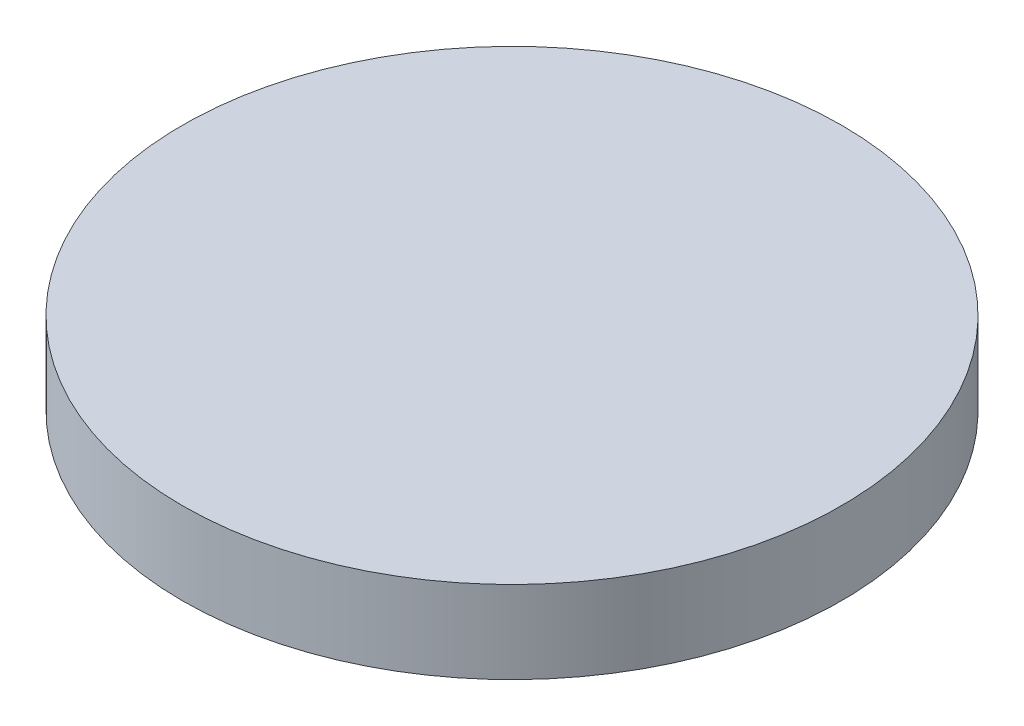
ISO-10303-21;
HEADER;
FILE_DESCRIPTION(('STEP AP214'),'2;1');
FILE_NAME('part.step','',(''),(''),'','','');
FILE_SCHEMA(('AUTOMOTIVE_DESIGN { 1 0 10303 214 1 1 1 1 }'));
ENDSEC;
DATA;
#1=APPLICATION_CONTEXT('core data for automotive mechanical design processes');
#2=APPLICATION_PROTOCOL_DEFINITION('international standard','automotive_design',2000,#1);
#3=PRODUCT_CONTEXT('',#1,'mechanical');
#4=PRODUCT('Part','Part','',(#3));
#5=PRODUCT_RELATED_PRODUCT_CATEGORY('part','',(#4));
#6=PRODUCT_DEFINITION_FORMATION('','',#4);
#7=PRODUCT_DEFINITION_CONTEXT('part definition',#1,'design');
#8=PRODUCT_DEFINITION('design','',#6,#7);
#9=PRODUCT_DEFINITION_SHAPE('','',#8);
#10=(LENGTH_UNIT() NAMED_UNIT(*) SI_UNIT(.MILLI.,.METRE.));
#11=(NAMED_UNIT(*) PLANE_ANGLE_UNIT() SI_UNIT($,.RADIAN.));
#12=(NAMED_UNIT(*) SI_UNIT($,.STERADIAN.) SOLID_ANGLE_UNIT());
#13=UNCERTAINTY_MEASURE_WITH_UNIT(LENGTH_MEASURE(1.E-05),#10,'distance_accuracy_value','');
#14=(GEOMETRIC_REPRESENTATION_CONTEXT(3) GLOBAL_UNCERTAINTY_ASSIGNED_CONTEXT((#13)) GLOBAL_UNIT_ASSIGNED_CONTEXT((#10,
#11,#12)) REPRESENTATION_CONTEXT('',''));
#15=CARTESIAN_POINT('',(0.,0.,0.));
#16=DIRECTION('',(0.,0.,1.));
#17=DIRECTION('',(1.,0.,0.));
#18=AXIS2_PLACEMENT_3D('',#15,#16,#17);
#19=CARTESIAN_POINT('',(0.,10.,0.));
#20=DIRECTION('',(0.,-1.,0.));
#21=DIRECTION('',(0.,0.,-1.));
#22=AXIS2_PLACEMENT_3D('',#19,#20,#21);
#23=CYLINDRICAL_SURFACE('',#22,40.);
#24=CARTESIAN_POINT('',(0.,10.,0.));
#25=DIRECTION('',(0.,1.,0.));
#26=DIRECTION('',(0.,0.,1.));
#27=AXIS2_PLACEMENT_3D('',#24,#25,#26);
#28=CIRCLE('',#27,40.);
#29=CARTESIAN_POINT('',(0.,10.,40.));
#30=VERTEX_POINT('',#29);
#31=EDGE_CURVE('E10',#30,#30,#28,.T.);
#32=ORIENTED_EDGE('',*,*,#31,.F.);
#33=EDGE_LOOP('',(#32));
#34=FACE_BOUND('',#33,.T.);
#35=CARTESIAN_POINT('',(0.,0.,0.));
#36=DIRECTION('',(0.,1.,0.));
#37=DIRECTION('',(0.,0.,1.));
#38=AXIS2_PLACEMENT_3D('',#35,#36,#37);
#39=CIRCLE('',#38,40.);
#40=CARTESIAN_POINT('',(0.,0.,40.));
#41=VERTEX_POINT('',#40);
#42=EDGE_CURVE('E34',#41,#41,#39,.T.);
#43=ORIENTED_EDGE('',*,*,#42,.T.);
#44=EDGE_LOOP('',(#43));
#45=FACE_BOUND('',#44,.T.);
#46=ADVANCED_FACE('F31',(#34,#45),#23,.T.);
#47=CARTESIAN_POINT('',(0.,10.,0.));
#48=DIRECTION('',(0.,1.,0.));
#49=DIRECTION('',(0.,0.,1.));
#50=AXIS2_PLACEMENT_3D('',#47,#48,#49);
#51=PLANE('',#50);
#52=ORIENTED_EDGE('',*,*,#31,.T.);
#53=EDGE_LOOP('',(#52));
#54=FACE_BOUND('',#53,.T.);
#55=ADVANCED_FACE('F46',(#54),#51,.T.);
#56=CARTESIAN_POINT('',(0.,0.,0.));
#57=DIRECTION('',(0.,1.,0.));
#58=DIRECTION('',(0.,0.,1.));
#59=AXIS2_PLACEMENT_3D('',#56,#57,#58);
#60=PLANE('',#59);
#61=ORIENTED_EDGE('',*,*,#42,.F.);
#62=EDGE_LOOP('',(#61));
#63=FACE_BOUND('',#62,.T.);
#64=ADVANCED_FACE('F44',(#63),#60,.F.);
#65=CLOSED_SHELL('',(#46,#55,#64));
#66=MANIFOLD_SOLID_BREP('B2',#65);
#67=ADVANCED_BREP_SHAPE_REPRESENTATION('',(#18,#66),#14);
#68=SHAPE_DEFINITION_REPRESENTATION(#9,#67);
ENDSEC;
END-ISO-10303-21;
